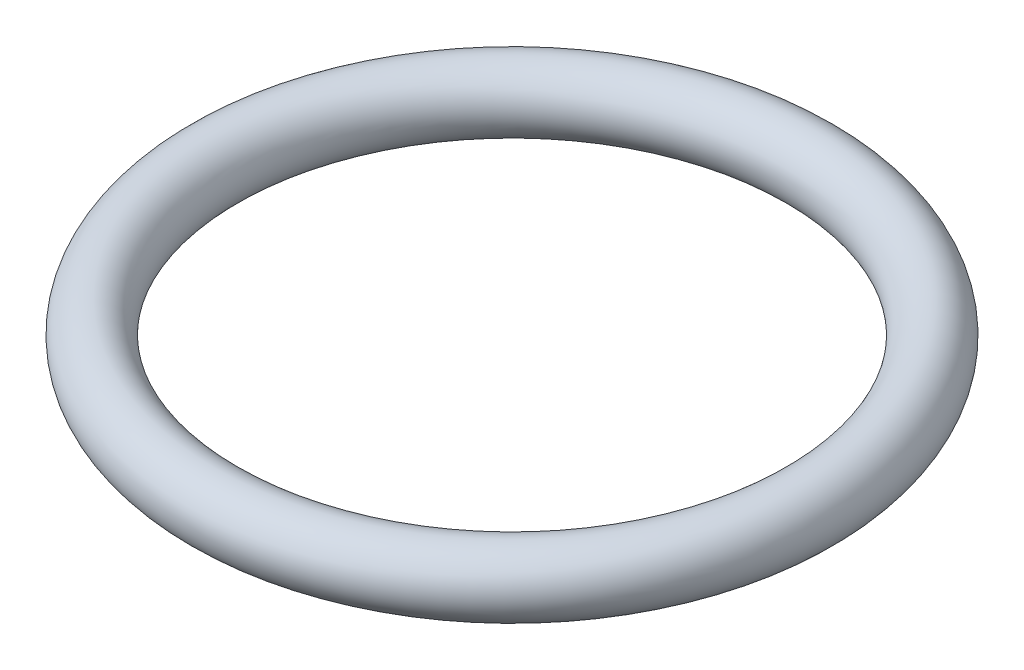
ISO-10303-21;
HEADER;
FILE_DESCRIPTION(('STEP AP214'),'2;1');
FILE_NAME('part.step','',(''),(''),'','','');
FILE_SCHEMA(('AUTOMOTIVE_DESIGN { 1 0 10303 214 1 1 1 1 }'));
ENDSEC;
DATA;
#1=APPLICATION_CONTEXT('core data for automotive mechanical design processes');
#2=APPLICATION_PROTOCOL_DEFINITION('international standard','automotive_design',2000,#1);
#3=PRODUCT_CONTEXT('',#1,'mechanical');
#4=PRODUCT('Part','Part','',(#3));
#5=PRODUCT_RELATED_PRODUCT_CATEGORY('part','',(#4));
#6=PRODUCT_DEFINITION_FORMATION('','',#4);
#7=PRODUCT_DEFINITION_CONTEXT('part definition',#1,'design');
#8=PRODUCT_DEFINITION('design','',#6,#7);
#9=PRODUCT_DEFINITION_SHAPE('','',#8);
#10=(LENGTH_UNIT() NAMED_UNIT(*) SI_UNIT(.MILLI.,.METRE.));
#11=(NAMED_UNIT(*) PLANE_ANGLE_UNIT() SI_UNIT($,.RADIAN.));
#12=(NAMED_UNIT(*) SI_UNIT($,.STERADIAN.) SOLID_ANGLE_UNIT());
#13=UNCERTAINTY_MEASURE_WITH_UNIT(LENGTH_MEASURE(1.E-05),#10,'distance_accuracy_value','');
#14=(GEOMETRIC_REPRESENTATION_CONTEXT(3) GLOBAL_UNCERTAINTY_ASSIGNED_CONTEXT((#13)) GLOBAL_UNIT_ASSIGNED_CONTEXT((#10,
#11,#12)) REPRESENTATION_CONTEXT('',''));
#15=CARTESIAN_POINT('',(0.,0.,0.));
#16=DIRECTION('',(0.,0.,1.));
#17=DIRECTION('',(1.,0.,0.));
#18=AXIS2_PLACEMENT_3D('',#15,#16,#17);
#19=CARTESIAN_POINT('',(0.,-1.8,0.));
#20=DIRECTION('',(0.,-1.,0.));
#21=DIRECTION('',(0.,0.,-1.));
#22=AXIS2_PLACEMENT_3D('',#19,#20,#21);
#23=TOROIDAL_SURFACE('',#22,7.35,0.8);
#24=CARTESIAN_POINT('',(0.,-1.8,-8.15));
#25=VERTEX_POINT('',#24);
#26=VERTEX_LOOP('',#25);
#27=FACE_BOUND('',#26,.T.);
#28=ADVANCED_FACE('F13',(#27),#23,.T.);
#29=CLOSED_SHELL('',(#28));
#30=MANIFOLD_SOLID_BREP('B1',#29);
#31=ADVANCED_BREP_SHAPE_REPRESENTATION('',(#18,#30),#14);
#32=SHAPE_DEFINITION_REPRESENTATION(#9,#31);
ENDSEC;
END-ISO-10303-21;
